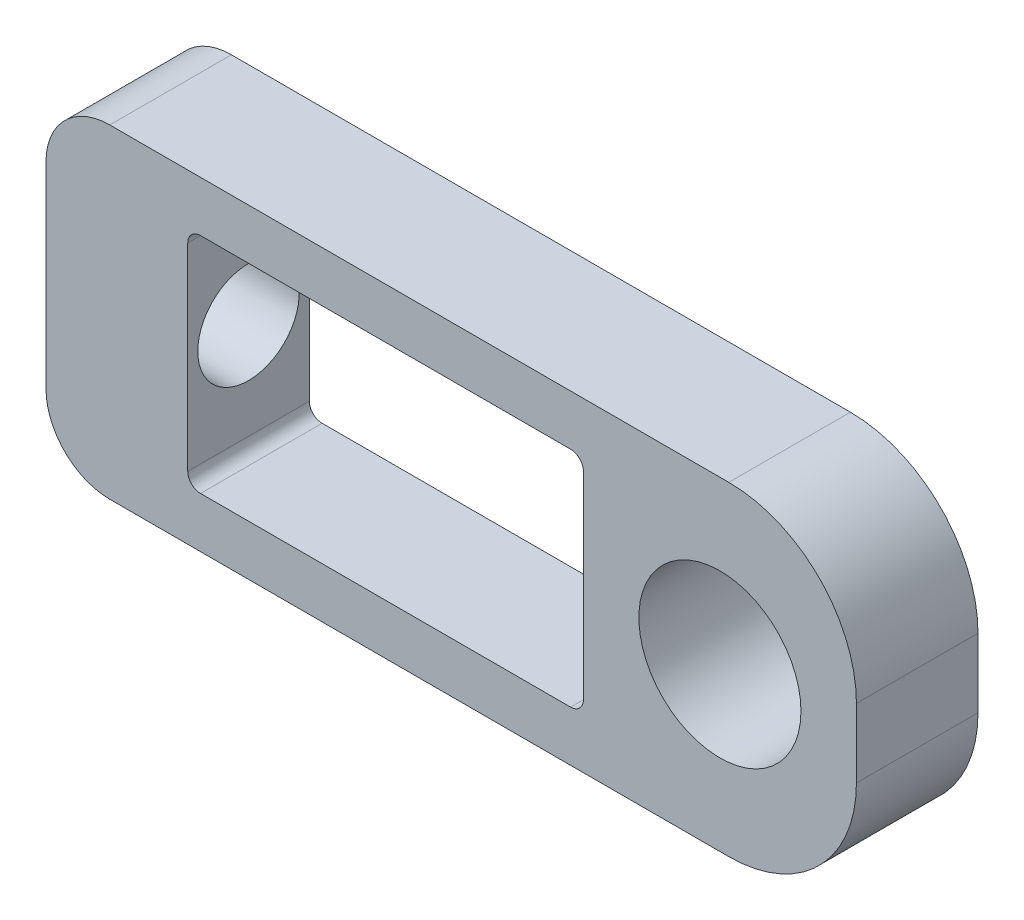
ISO-10303-21;
HEADER;
FILE_DESCRIPTION(('STEP AP214'),'2;1');
FILE_NAME('part.step','',(''),(''),'','','');
FILE_SCHEMA(('AUTOMOTIVE_DESIGN { 1 0 10303 214 1 1 1 1 }'));
ENDSEC;
DATA;
#1=APPLICATION_CONTEXT('core data for automotive mechanical design processes');
#2=APPLICATION_PROTOCOL_DEFINITION('international standard','automotive_design',2000,#1);
#3=PRODUCT_CONTEXT('',#1,'mechanical');
#4=PRODUCT('Part','Part','',(#3));
#5=PRODUCT_RELATED_PRODUCT_CATEGORY('part','',(#4));
#6=PRODUCT_DEFINITION_FORMATION('','',#4);
#7=PRODUCT_DEFINITION_CONTEXT('part definition',#1,'design');
#8=PRODUCT_DEFINITION('design','',#6,#7);
#9=PRODUCT_DEFINITION_SHAPE('','',#8);
#10=(LENGTH_UNIT() NAMED_UNIT(*) SI_UNIT(.MILLI.,.METRE.));
#11=(NAMED_UNIT(*) PLANE_ANGLE_UNIT() SI_UNIT($,.RADIAN.));
#12=(NAMED_UNIT(*) SI_UNIT($,.STERADIAN.) SOLID_ANGLE_UNIT());
#13=UNCERTAINTY_MEASURE_WITH_UNIT(LENGTH_MEASURE(1.E-05),#10,'distance_accuracy_value','');
#14=(GEOMETRIC_REPRESENTATION_CONTEXT(3) GLOBAL_UNCERTAINTY_ASSIGNED_CONTEXT((#13)) GLOBAL_UNIT_ASSIGNED_CONTEXT((#10,
#11,#12)) REPRESENTATION_CONTEXT('',''));
#15=CARTESIAN_POINT('',(0.,0.,0.));
#16=DIRECTION('',(0.,0.,1.));
#17=DIRECTION('',(1.,0.,0.));
#18=AXIS2_PLACEMENT_3D('',#15,#16,#17);
#19=CARTESIAN_POINT('',(0.,0.,9.525));
#20=DIRECTION('',(1.,0.,0.));
#21=DIRECTION('',(0.,0.,-1.));
#22=AXIS2_PLACEMENT_3D('',#19,#20,#21);
#23=PLANE('',#22);
#24=CARTESIAN_POINT('',(0.,12.7,4.7625));
#25=DIRECTION('',(-1.,0.,0.));
#26=DIRECTION('',(0.,0.,1.));
#27=AXIS2_PLACEMENT_3D('',#24,#25,#26);
#28=CIRCLE('',#27,3.9751);
#29=CARTESIAN_POINT('',(0.,12.7,8.7376));
#30=VERTEX_POINT('',#29);
#31=EDGE_CURVE('E312',#30,#30,#28,.T.);
#32=ORIENTED_EDGE('',*,*,#31,.F.);
#33=EDGE_LOOP('',(#32));
#34=FACE_BOUND('',#33,.T.);
#35=DIRECTION('',(0.,-1.,0.));
#36=VECTOR('',#35,1.);
#37=CARTESIAN_POINT('',(0.,0.,0.));
#38=LINE('',#37,#36);
#39=CARTESIAN_POINT('',(0.,20.4,0.));
#40=VERTEX_POINT('',#39);
#41=CARTESIAN_POINT('',(0.,5.,0.));
#42=VERTEX_POINT('',#41);
#43=EDGE_CURVE('E191',#40,#42,#38,.T.);
#44=ORIENTED_EDGE('',*,*,#43,.T.);
#45=DIRECTION('',(0.,0.,-1.));
#46=VECTOR('',#45,1.);
#47=CARTESIAN_POINT('',(0.,5.,9.525));
#48=LINE('',#47,#46);
#49=CARTESIAN_POINT('',(0.,5.,9.525));
#50=VERTEX_POINT('',#49);
#51=EDGE_CURVE('E216',#42,#50,#48,.F.);
#52=ORIENTED_EDGE('',*,*,#51,.T.);
#53=DIRECTION('',(0.,-1.,0.));
#54=VECTOR('',#53,1.);
#55=CARTESIAN_POINT('',(0.,0.,9.525));
#56=LINE('',#55,#54);
#57=CARTESIAN_POINT('',(0.,20.4,9.525));
#58=VERTEX_POINT('',#57);
#59=EDGE_CURVE('E189',#58,#50,#56,.T.);
#60=ORIENTED_EDGE('',*,*,#59,.F.);
#61=DIRECTION('',(0.,0.,-1.));
#62=VECTOR('',#61,1.);
#63=CARTESIAN_POINT('',(0.,20.4,9.525));
#64=LINE('',#63,#62);
#65=EDGE_CURVE('E213',#58,#40,#64,.T.);
#66=ORIENTED_EDGE('',*,*,#65,.T.);
#67=EDGE_LOOP('',(#44,#52,#60,#66));
#68=FACE_BOUND('',#67,.T.);
#69=ADVANCED_FACE('F46',(#34,#68),#23,.F.);
#70=CARTESIAN_POINT('',(0.,0.,9.525));
#71=DIRECTION('',(0.,1.,0.));
#72=DIRECTION('',(0.,0.,1.));
#73=AXIS2_PLACEMENT_3D('',#70,#71,#72);
#74=PLANE('',#73);
#75=DIRECTION('',(1.,0.,0.));
#76=VECTOR('',#75,1.);
#77=CARTESIAN_POINT('',(0.,0.,9.525));
#78=LINE('',#77,#76);
#79=CARTESIAN_POINT('',(5.,0.,9.525));
#80=VERTEX_POINT('',#79);
#81=CARTESIAN_POINT('',(53.5,0.,9.525));
#82=VERTEX_POINT('',#81);
#83=EDGE_CURVE('E295',#80,#82,#78,.T.);
#84=ORIENTED_EDGE('',*,*,#83,.F.);
#85=DIRECTION('',(0.,0.,-1.));
#86=VECTOR('',#85,1.);
#87=CARTESIAN_POINT('',(5.,0.,9.525));
#88=LINE('',#87,#86);
#89=CARTESIAN_POINT('',(5.,0.,0.));
#90=VERTEX_POINT('',#89);
#91=EDGE_CURVE('E206',#80,#90,#88,.T.);
#92=ORIENTED_EDGE('',*,*,#91,.T.);
#93=DIRECTION('',(1.,0.,0.));
#94=VECTOR('',#93,1.);
#95=CARTESIAN_POINT('',(0.,0.,0.));
#96=LINE('',#95,#94);
#97=CARTESIAN_POINT('',(53.5,0.,0.));
#98=VERTEX_POINT('',#97);
#99=EDGE_CURVE('E186',#90,#98,#96,.T.);
#100=ORIENTED_EDGE('',*,*,#99,.T.);
#101=DIRECTION('',(0.,0.,-1.));
#102=VECTOR('',#101,1.);
#103=CARTESIAN_POINT('',(53.5,0.,9.525));
#104=LINE('',#103,#102);
#105=EDGE_CURVE('E167',#98,#82,#104,.F.);
#106=ORIENTED_EDGE('',*,*,#105,.T.);
#107=EDGE_LOOP('',(#84,#92,#100,#106));
#108=FACE_BOUND('',#107,.T.);
#109=ADVANCED_FACE('F320',(#108),#74,.F.);
#110=CARTESIAN_POINT('',(63.5,0.,9.525));
#111=DIRECTION('',(-1.,0.,0.));
#112=DIRECTION('',(0.,0.,1.));
#113=AXIS2_PLACEMENT_3D('',#110,#111,#112);
#114=PLANE('',#113);
#115=DIRECTION('',(0.,1.,0.));
#116=VECTOR('',#115,1.);
#117=CARTESIAN_POINT('',(63.5,0.,9.525));
#118=LINE('',#117,#116);
#119=CARTESIAN_POINT('',(63.5,10.,9.525));
#120=VERTEX_POINT('',#119);
#121=CARTESIAN_POINT('',(63.5,15.4,9.525));
#122=VERTEX_POINT('',#121);
#123=EDGE_CURVE('E180',#120,#122,#118,.T.);
#124=ORIENTED_EDGE('',*,*,#123,.F.);
#125=DIRECTION('',(0.,0.,-1.));
#126=VECTOR('',#125,1.);
#127=CARTESIAN_POINT('',(63.5,10.,9.525));
#128=LINE('',#127,#126);
#129=CARTESIAN_POINT('',(63.5,10.,0.));
#130=VERTEX_POINT('',#129);
#131=EDGE_CURVE('E165',#120,#130,#128,.T.);
#132=ORIENTED_EDGE('',*,*,#131,.T.);
#133=DIRECTION('',(0.,1.,0.));
#134=VECTOR('',#133,1.);
#135=CARTESIAN_POINT('',(63.5,0.,0.));
#136=LINE('',#135,#134);
#137=CARTESIAN_POINT('',(63.5,15.4,0.));
#138=VERTEX_POINT('',#137);
#139=EDGE_CURVE('E177',#130,#138,#136,.T.);
#140=ORIENTED_EDGE('',*,*,#139,.T.);
#141=DIRECTION('',(0.,0.,-1.));
#142=VECTOR('',#141,1.);
#143=CARTESIAN_POINT('',(63.5,15.4,9.525));
#144=LINE('',#143,#142);
#145=EDGE_CURVE('E181',#138,#122,#144,.F.);
#146=ORIENTED_EDGE('',*,*,#145,.T.);
#147=EDGE_LOOP('',(#124,#132,#140,#146));
#148=FACE_BOUND('',#147,.T.);
#149=ADVANCED_FACE('F176',(#148),#114,.F.);
#150=CARTESIAN_POINT('',(0.,25.4,9.525));
#151=DIRECTION('',(0.,-1.,0.));
#152=DIRECTION('',(1.,0.,0.));
#153=AXIS2_PLACEMENT_3D('',#150,#151,#152);
#154=PLANE('',#153);
#155=DIRECTION('',(-1.,0.,0.));
#156=VECTOR('',#155,1.);
#157=CARTESIAN_POINT('',(0.,25.4,0.));
#158=LINE('',#157,#156);
#159=CARTESIAN_POINT('',(53.5,25.4,0.));
#160=VERTEX_POINT('',#159);
#161=CARTESIAN_POINT('',(5.,25.4,0.));
#162=VERTEX_POINT('',#161);
#163=EDGE_CURVE('E185',#160,#162,#158,.T.);
#164=ORIENTED_EDGE('',*,*,#163,.T.);
#165=DIRECTION('',(0.,0.,-1.));
#166=VECTOR('',#165,1.);
#167=CARTESIAN_POINT('',(5.,25.4,9.525));
#168=LINE('',#167,#166);
#169=CARTESIAN_POINT('',(5.,25.4,9.525));
#170=VERTEX_POINT('',#169);
#171=EDGE_CURVE('E222',#162,#170,#168,.F.);
#172=ORIENTED_EDGE('',*,*,#171,.T.);
#173=DIRECTION('',(-1.,0.,0.));
#174=VECTOR('',#173,1.);
#175=CARTESIAN_POINT('',(0.,25.4,9.525));
#176=LINE('',#175,#174);
#177=CARTESIAN_POINT('',(53.5,25.4,9.525));
#178=VERTEX_POINT('',#177);
#179=EDGE_CURVE('E195',#178,#170,#176,.T.);
#180=ORIENTED_EDGE('',*,*,#179,.F.);
#181=DIRECTION('',(0.,0.,-1.));
#182=VECTOR('',#181,1.);
#183=CARTESIAN_POINT('',(53.5,25.4,9.525));
#184=LINE('',#183,#182);
#185=EDGE_CURVE('E203',#178,#160,#184,.T.);
#186=ORIENTED_EDGE('',*,*,#185,.T.);
#187=EDGE_LOOP('',(#164,#172,#180,#186));
#188=FACE_BOUND('',#187,.T.);
#189=ADVANCED_FACE('F386',(#188),#154,.F.);
#190=CARTESIAN_POINT('',(0.,0.,9.525));
#191=DIRECTION('',(0.,0.,-1.));
#192=DIRECTION('',(-1.,0.,0.));
#193=AXIS2_PLACEMENT_3D('',#190,#191,#192);
#194=PLANE('',#193);
#195=CARTESIAN_POINT('',(52.803125,12.7,9.525));
#196=DIRECTION('',(0.,0.,1.));
#197=DIRECTION('',(1.,0.,0.));
#198=AXIS2_PLACEMENT_3D('',#195,#196,#197);
#199=CIRCLE('',#198,6.35);
#200=CARTESIAN_POINT('',(59.153125,12.7,9.525));
#201=VERTEX_POINT('',#200);
#202=EDGE_CURVE('E285',#201,#201,#199,.T.);
#203=ORIENTED_EDGE('',*,*,#202,.F.);
#204=EDGE_LOOP('',(#203));
#205=FACE_BOUND('',#204,.T.);
#206=DIRECTION('',(-1.,0.,0.));
#207=VECTOR('',#206,1.);
#208=CARTESIAN_POINT('',(11.10625,21.45,9.525));
#209=LINE('',#208,#207);
#210=CARTESIAN_POINT('',(41.10625,21.45,9.525));
#211=VERTEX_POINT('',#210);
#212=CARTESIAN_POINT('',(12.10625,21.45,9.525));
#213=VERTEX_POINT('',#212);
#214=EDGE_CURVE('E260',#211,#213,#209,.T.);
#215=ORIENTED_EDGE('',*,*,#214,.F.);
#216=CARTESIAN_POINT('',(41.10625,20.45,9.525));
#217=DIRECTION('',(0.,0.,-1.));
#218=DIRECTION('',(-1.,0.,0.));
#219=AXIS2_PLACEMENT_3D('',#216,#217,#218);
#220=CIRCLE('',#219,1.);
#221=CARTESIAN_POINT('',(42.10625,20.45,9.525));
#222=VERTEX_POINT('',#221);
#223=EDGE_CURVE('E54',#211,#222,#220,.T.);
#224=ORIENTED_EDGE('',*,*,#223,.T.);
#225=DIRECTION('',(0.,1.,0.));
#226=VECTOR('',#225,1.);
#227=CARTESIAN_POINT('',(42.10625,3.95,9.525));
#228=LINE('',#227,#226);
#229=CARTESIAN_POINT('',(42.10625,4.95,9.525));
#230=VERTEX_POINT('',#229);
#231=EDGE_CURVE('E258',#230,#222,#228,.T.);
#232=ORIENTED_EDGE('',*,*,#231,.F.);
#233=CARTESIAN_POINT('',(41.10625,4.95,9.525));
#234=DIRECTION('',(0.,0.,-1.));
#235=DIRECTION('',(-1.,0.,0.));
#236=AXIS2_PLACEMENT_3D('',#233,#234,#235);
#237=CIRCLE('',#236,1.);
#238=CARTESIAN_POINT('',(41.10625,3.95,9.525));
#239=VERTEX_POINT('',#238);
#240=EDGE_CURVE('E251',#230,#239,#237,.T.);
#241=ORIENTED_EDGE('',*,*,#240,.T.);
#242=DIRECTION('',(1.,0.,0.));
#243=VECTOR('',#242,1.);
#244=CARTESIAN_POINT('',(11.10625,3.95,9.525));
#245=LINE('',#244,#243);
#246=CARTESIAN_POINT('',(12.10625,3.95,9.525));
#247=VERTEX_POINT('',#246);
#248=EDGE_CURVE('E281',#247,#239,#245,.T.);
#249=ORIENTED_EDGE('',*,*,#248,.F.);
#250=CARTESIAN_POINT('',(12.10625,4.95,9.525));
#251=DIRECTION('',(0.,0.,-1.));
#252=DIRECTION('',(-1.,0.,0.));
#253=AXIS2_PLACEMENT_3D('',#250,#251,#252);
#254=CIRCLE('',#253,1.);
#255=CARTESIAN_POINT('',(11.10625,4.95,9.525));
#256=VERTEX_POINT('',#255);
#257=EDGE_CURVE('E247',#247,#256,#254,.T.);
#258=ORIENTED_EDGE('',*,*,#257,.T.);
#259=DIRECTION('',(0.,-1.,0.));
#260=VECTOR('',#259,1.);
#261=CARTESIAN_POINT('',(11.10625,3.95,9.525));
#262=LINE('',#261,#260);
#263=CARTESIAN_POINT('',(11.10625,20.45,9.525));
#264=VERTEX_POINT('',#263);
#265=EDGE_CURVE('E288',#264,#256,#262,.T.);
#266=ORIENTED_EDGE('',*,*,#265,.F.);
#267=CARTESIAN_POINT('',(12.10625,20.45,9.525));
#268=DIRECTION('',(0.,0.,-1.));
#269=DIRECTION('',(-1.,0.,0.));
#270=AXIS2_PLACEMENT_3D('',#267,#268,#269);
#271=CIRCLE('',#270,1.);
#272=EDGE_CURVE('E243',#264,#213,#271,.T.);
#273=ORIENTED_EDGE('',*,*,#272,.T.);
#274=EDGE_LOOP('',(#215,#224,#232,#241,#249,#258,#266,#273));
#275=FACE_BOUND('',#274,.T.);
#276=ORIENTED_EDGE('',*,*,#59,.T.);
#277=CARTESIAN_POINT('',(5.,5.,9.525));
#278=DIRECTION('',(0.,0.,-1.));
#279=DIRECTION('',(-1.,0.,0.));
#280=AXIS2_PLACEMENT_3D('',#277,#278,#279);
#281=CIRCLE('',#280,5.);
#282=EDGE_CURVE('E220',#50,#80,#281,.F.);
#283=ORIENTED_EDGE('',*,*,#282,.T.);
#284=ORIENTED_EDGE('',*,*,#83,.T.);
#285=CARTESIAN_POINT('',(53.5,10.,9.525));
#286=DIRECTION('',(0.,0.,-1.));
#287=DIRECTION('',(-1.,0.,0.));
#288=AXIS2_PLACEMENT_3D('',#285,#286,#287);
#289=CIRCLE('',#288,10.);
#290=EDGE_CURVE('E201',#82,#120,#289,.F.);
#291=ORIENTED_EDGE('',*,*,#290,.T.);
#292=ORIENTED_EDGE('',*,*,#123,.T.);
#293=CARTESIAN_POINT('',(53.5,15.4,9.525));
#294=DIRECTION('',(0.,0.,-1.));
#295=DIRECTION('',(-1.,0.,0.));
#296=AXIS2_PLACEMENT_3D('',#293,#294,#295);
#297=CIRCLE('',#296,10.);
#298=EDGE_CURVE('E199',#122,#178,#297,.F.);
#299=ORIENTED_EDGE('',*,*,#298,.T.);
#300=ORIENTED_EDGE('',*,*,#179,.T.);
#301=CARTESIAN_POINT('',(5.,20.4,9.525));
#302=DIRECTION('',(0.,0.,-1.));
#303=DIRECTION('',(-1.,0.,0.));
#304=AXIS2_PLACEMENT_3D('',#301,#302,#303);
#305=CIRCLE('',#304,5.);
#306=EDGE_CURVE('E218',#170,#58,#305,.F.);
#307=ORIENTED_EDGE('',*,*,#306,.T.);
#308=EDGE_LOOP('',(#276,#283,#284,#291,#292,#299,#300,#307));
#309=FACE_BOUND('',#308,.T.);
#310=ADVANCED_FACE('F256',(#205,#275,#309),#194,.F.);
#311=CARTESIAN_POINT('',(0.,0.,0.));
#312=DIRECTION('',(0.,0.,-1.));
#313=DIRECTION('',(-1.,0.,0.));
#314=AXIS2_PLACEMENT_3D('',#311,#312,#313);
#315=PLANE('',#314);
#316=CARTESIAN_POINT('',(52.803125,12.7,0.));
#317=DIRECTION('',(0.,0.,1.));
#318=DIRECTION('',(1.,0.,0.));
#319=AXIS2_PLACEMENT_3D('',#316,#317,#318);
#320=CIRCLE('',#319,6.35);
#321=CARTESIAN_POINT('',(59.153125,12.7,0.));
#322=VERTEX_POINT('',#321);
#323=EDGE_CURVE('E300',#322,#322,#320,.T.);
#324=ORIENTED_EDGE('',*,*,#323,.T.);
#325=EDGE_LOOP('',(#324));
#326=FACE_BOUND('',#325,.T.);
#327=DIRECTION('',(1.,0.,0.));
#328=VECTOR('',#327,1.);
#329=CARTESIAN_POINT('',(11.10625,3.95,0.));
#330=LINE('',#329,#328);
#331=CARTESIAN_POINT('',(12.10625,3.95,0.));
#332=VERTEX_POINT('',#331);
#333=CARTESIAN_POINT('',(41.10625,3.95,0.));
#334=VERTEX_POINT('',#333);
#335=EDGE_CURVE('E279',#332,#334,#330,.T.);
#336=ORIENTED_EDGE('',*,*,#335,.T.);
#337=CARTESIAN_POINT('',(41.10625,4.95,0.));
#338=DIRECTION('',(0.,0.,-1.));
#339=DIRECTION('',(-1.,0.,0.));
#340=AXIS2_PLACEMENT_3D('',#337,#338,#339);
#341=CIRCLE('',#340,1.);
#342=CARTESIAN_POINT('',(42.10625,4.95,0.));
#343=VERTEX_POINT('',#342);
#344=EDGE_CURVE('E68',#334,#343,#341,.F.);
#345=ORIENTED_EDGE('',*,*,#344,.T.);
#346=DIRECTION('',(0.,1.,0.));
#347=VECTOR('',#346,1.);
#348=CARTESIAN_POINT('',(42.10625,3.95,0.));
#349=LINE('',#348,#347);
#350=CARTESIAN_POINT('',(42.10625,20.45,0.));
#351=VERTEX_POINT('',#350);
#352=EDGE_CURVE('E272',#343,#351,#349,.T.);
#353=ORIENTED_EDGE('',*,*,#352,.T.);
#354=CARTESIAN_POINT('',(41.10625,20.45,0.));
#355=DIRECTION('',(0.,0.,-1.));
#356=DIRECTION('',(-1.,0.,0.));
#357=AXIS2_PLACEMENT_3D('',#354,#355,#356);
#358=CIRCLE('',#357,1.);
#359=CARTESIAN_POINT('',(41.10625,21.45,0.));
#360=VERTEX_POINT('',#359);
#361=EDGE_CURVE('E13',#351,#360,#358,.F.);
#362=ORIENTED_EDGE('',*,*,#361,.T.);
#363=DIRECTION('',(-1.,0.,0.));
#364=VECTOR('',#363,1.);
#365=CARTESIAN_POINT('',(11.10625,21.45,0.));
#366=LINE('',#365,#364);
#367=CARTESIAN_POINT('',(12.10625,21.45,0.));
#368=VERTEX_POINT('',#367);
#369=EDGE_CURVE('E270',#360,#368,#366,.T.);
#370=ORIENTED_EDGE('',*,*,#369,.T.);
#371=CARTESIAN_POINT('',(12.10625,20.45,0.));
#372=DIRECTION('',(0.,0.,-1.));
#373=DIRECTION('',(-1.,0.,0.));
#374=AXIS2_PLACEMENT_3D('',#371,#372,#373);
#375=CIRCLE('',#374,1.);
#376=CARTESIAN_POINT('',(11.10625,20.45,0.));
#377=VERTEX_POINT('',#376);
#378=EDGE_CURVE('E245',#368,#377,#375,.F.);
#379=ORIENTED_EDGE('',*,*,#378,.T.);
#380=DIRECTION('',(0.,-1.,0.));
#381=VECTOR('',#380,1.);
#382=CARTESIAN_POINT('',(11.10625,3.95,0.));
#383=LINE('',#382,#381);
#384=CARTESIAN_POINT('',(11.10625,4.95,0.));
#385=VERTEX_POINT('',#384);
#386=EDGE_CURVE('E276',#377,#385,#383,.T.);
#387=ORIENTED_EDGE('',*,*,#386,.T.);
#388=CARTESIAN_POINT('',(12.10625,4.95,0.));
#389=DIRECTION('',(0.,0.,-1.));
#390=DIRECTION('',(-1.,0.,0.));
#391=AXIS2_PLACEMENT_3D('',#388,#389,#390);
#392=CIRCLE('',#391,1.);
#393=EDGE_CURVE('E249',#385,#332,#392,.F.);
#394=ORIENTED_EDGE('',*,*,#393,.T.);
#395=EDGE_LOOP('',(#336,#345,#353,#362,#370,#379,#387,#394));
#396=FACE_BOUND('',#395,.T.);
#397=ORIENTED_EDGE('',*,*,#99,.F.);
#398=CARTESIAN_POINT('',(5.,5.,0.));
#399=DIRECTION('',(0.,0.,-1.));
#400=DIRECTION('',(-1.,0.,0.));
#401=AXIS2_PLACEMENT_3D('',#398,#399,#400);
#402=CIRCLE('',#401,5.);
#403=EDGE_CURVE('E211',#90,#42,#402,.T.);
#404=ORIENTED_EDGE('',*,*,#403,.T.);
#405=ORIENTED_EDGE('',*,*,#43,.F.);
#406=CARTESIAN_POINT('',(5.,20.4,0.));
#407=DIRECTION('',(0.,0.,-1.));
#408=DIRECTION('',(-1.,0.,0.));
#409=AXIS2_PLACEMENT_3D('',#406,#407,#408);
#410=CIRCLE('',#409,5.);
#411=EDGE_CURVE('E209',#40,#162,#410,.T.);
#412=ORIENTED_EDGE('',*,*,#411,.T.);
#413=ORIENTED_EDGE('',*,*,#163,.F.);
#414=CARTESIAN_POINT('',(53.5,15.4,0.));
#415=DIRECTION('',(0.,0.,-1.));
#416=DIRECTION('',(-1.,0.,0.));
#417=AXIS2_PLACEMENT_3D('',#414,#415,#416);
#418=CIRCLE('',#417,10.);
#419=EDGE_CURVE('E171',#160,#138,#418,.T.);
#420=ORIENTED_EDGE('',*,*,#419,.T.);
#421=ORIENTED_EDGE('',*,*,#139,.F.);
#422=CARTESIAN_POINT('',(53.5,10.,0.));
#423=DIRECTION('',(0.,0.,-1.));
#424=DIRECTION('',(-1.,0.,0.));
#425=AXIS2_PLACEMENT_3D('',#422,#423,#424);
#426=CIRCLE('',#425,10.);
#427=EDGE_CURVE('E161',#130,#98,#426,.T.);
#428=ORIENTED_EDGE('',*,*,#427,.T.);
#429=EDGE_LOOP('',(#397,#404,#405,#412,#413,#420,#421,#428));
#430=FACE_BOUND('',#429,.T.);
#431=ADVANCED_FACE('F183',(#326,#396,#430),#315,.T.);
#432=CARTESIAN_POINT('',(42.10625,3.95,0.));
#433=DIRECTION('',(1.,0.,0.));
#434=DIRECTION('',(0.,0.,-1.));
#435=AXIS2_PLACEMENT_3D('',#432,#433,#434);
#436=PLANE('',#435);
#437=ORIENTED_EDGE('',*,*,#352,.F.);
#438=DIRECTION('',(0.,0.,1.));
#439=VECTOR('',#438,1.);
#440=CARTESIAN_POINT('',(42.10625,4.95,9.525));
#441=LINE('',#440,#439);
#442=EDGE_CURVE('E240',#343,#230,#441,.T.);
#443=ORIENTED_EDGE('',*,*,#442,.T.);
#444=ORIENTED_EDGE('',*,*,#231,.T.);
#445=DIRECTION('',(0.,0.,1.));
#446=VECTOR('',#445,1.);
#447=CARTESIAN_POINT('',(42.10625,20.45,0.));
#448=LINE('',#447,#446);
#449=EDGE_CURVE('E61',#222,#351,#448,.F.);
#450=ORIENTED_EDGE('',*,*,#449,.T.);
#451=EDGE_LOOP('',(#437,#443,#444,#450));
#452=FACE_BOUND('',#451,.T.);
#453=ADVANCED_FACE('F263',(#452),#436,.F.);
#454=CARTESIAN_POINT('',(11.10625,3.95,0.));
#455=DIRECTION('',(0.,-1.,0.));
#456=DIRECTION('',(0.,0.,-1.));
#457=AXIS2_PLACEMENT_3D('',#454,#455,#456);
#458=PLANE('',#457);
#459=ORIENTED_EDGE('',*,*,#335,.F.);
#460=DIRECTION('',(0.,0.,1.));
#461=VECTOR('',#460,1.);
#462=CARTESIAN_POINT('',(12.10625,3.95,9.525));
#463=LINE('',#462,#461);
#464=EDGE_CURVE('E236',#332,#247,#463,.T.);
#465=ORIENTED_EDGE('',*,*,#464,.T.);
#466=ORIENTED_EDGE('',*,*,#248,.T.);
#467=DIRECTION('',(0.,0.,1.));
#468=VECTOR('',#467,1.);
#469=CARTESIAN_POINT('',(41.10625,3.95,0.));
#470=LINE('',#469,#468);
#471=EDGE_CURVE('E234',#239,#334,#470,.F.);
#472=ORIENTED_EDGE('',*,*,#471,.T.);
#473=EDGE_LOOP('',(#459,#465,#466,#472));
#474=FACE_BOUND('',#473,.T.);
#475=ADVANCED_FACE('F360',(#474),#458,.F.);
#476=CARTESIAN_POINT('',(11.10625,3.95,0.));
#477=DIRECTION('',(-1.,0.,0.));
#478=DIRECTION('',(0.,0.,1.));
#479=AXIS2_PLACEMENT_3D('',#476,#477,#478);
#480=PLANE('',#479);
#481=CARTESIAN_POINT('',(11.10625,12.7,4.7625));
#482=DIRECTION('',(-1.,0.,0.));
#483=DIRECTION('',(0.,0.,1.));
#484=AXIS2_PLACEMENT_3D('',#481,#482,#483);
#485=CIRCLE('',#484,3.9751);
#486=CARTESIAN_POINT('',(11.10625,12.7,8.7376));
#487=VERTEX_POINT('',#486);
#488=EDGE_CURVE('E265',#487,#487,#485,.F.);
#489=ORIENTED_EDGE('',*,*,#488,.F.);
#490=EDGE_LOOP('',(#489));
#491=FACE_BOUND('',#490,.T.);
#492=ORIENTED_EDGE('',*,*,#386,.F.);
#493=DIRECTION('',(0.,0.,1.));
#494=VECTOR('',#493,1.);
#495=CARTESIAN_POINT('',(11.10625,20.45,9.525));
#496=LINE('',#495,#494);
#497=EDGE_CURVE('E226',#377,#264,#496,.T.);
#498=ORIENTED_EDGE('',*,*,#497,.T.);
#499=ORIENTED_EDGE('',*,*,#265,.T.);
#500=DIRECTION('',(0.,0.,1.));
#501=VECTOR('',#500,1.);
#502=CARTESIAN_POINT('',(11.10625,4.95,0.));
#503=LINE('',#502,#501);
#504=EDGE_CURVE('E224',#256,#385,#503,.F.);
#505=ORIENTED_EDGE('',*,*,#504,.T.);
#506=EDGE_LOOP('',(#492,#498,#499,#505));
#507=FACE_BOUND('',#506,.T.);
#508=ADVANCED_FACE('F367',(#491,#507),#480,.F.);
#509=CARTESIAN_POINT('',(11.10625,21.45,0.));
#510=DIRECTION('',(0.,1.,0.));
#511=DIRECTION('',(0.,0.,1.));
#512=AXIS2_PLACEMENT_3D('',#509,#510,#511);
#513=PLANE('',#512);
#514=ORIENTED_EDGE('',*,*,#214,.T.);
#515=DIRECTION('',(0.,0.,1.));
#516=VECTOR('',#515,1.);
#517=CARTESIAN_POINT('',(12.10625,21.45,0.));
#518=LINE('',#517,#516);
#519=EDGE_CURVE('E232',#213,#368,#518,.F.);
#520=ORIENTED_EDGE('',*,*,#519,.T.);
#521=ORIENTED_EDGE('',*,*,#369,.F.);
#522=DIRECTION('',(0.,0.,1.));
#523=VECTOR('',#522,1.);
#524=CARTESIAN_POINT('',(41.10625,21.45,9.525));
#525=LINE('',#524,#523);
#526=EDGE_CURVE('E229',#360,#211,#525,.T.);
#527=ORIENTED_EDGE('',*,*,#526,.T.);
#528=EDGE_LOOP('',(#514,#520,#521,#527));
#529=FACE_BOUND('',#528,.T.);
#530=ADVANCED_FACE('F274',(#529),#513,.F.);
#531=CARTESIAN_POINT('',(52.803125,12.7,0.));
#532=DIRECTION('',(0.,0.,1.));
#533=DIRECTION('',(1.,0.,0.));
#534=AXIS2_PLACEMENT_3D('',#531,#532,#533);
#535=CYLINDRICAL_SURFACE('',#534,6.35);
#536=ORIENTED_EDGE('',*,*,#323,.F.);
#537=EDGE_LOOP('',(#536));
#538=FACE_BOUND('',#537,.T.);
#539=ORIENTED_EDGE('',*,*,#202,.T.);
#540=EDGE_LOOP('',(#539));
#541=FACE_BOUND('',#540,.T.);
#542=ADVANCED_FACE('F376',(#538,#541),#535,.F.);
#543=CARTESIAN_POINT('',(63.501,12.7,4.7625));
#544=DIRECTION('',(-1.,0.,0.));
#545=DIRECTION('',(0.,0.,1.));
#546=AXIS2_PLACEMENT_3D('',#543,#544,#545);
#547=CYLINDRICAL_SURFACE('',#546,3.9751);
#548=ORIENTED_EDGE('',*,*,#31,.T.);
#549=EDGE_LOOP('',(#548));
#550=FACE_BOUND('',#549,.T.);
#551=ORIENTED_EDGE('',*,*,#488,.T.);
#552=EDGE_LOOP('',(#551));
#553=FACE_BOUND('',#552,.T.);
#554=ADVANCED_FACE('F316',(#550,#553),#547,.F.);
#555=CARTESIAN_POINT('',(53.5,10.,9.525));
#556=DIRECTION('',(0.,0.,-1.));
#557=DIRECTION('',(-1.,0.,0.));
#558=AXIS2_PLACEMENT_3D('',#555,#556,#557);
#559=CYLINDRICAL_SURFACE('',#558,10.);
#560=ORIENTED_EDGE('',*,*,#290,.F.);
#561=ORIENTED_EDGE('',*,*,#105,.F.);
#562=ORIENTED_EDGE('',*,*,#427,.F.);
#563=ORIENTED_EDGE('',*,*,#131,.F.);
#564=EDGE_LOOP('',(#560,#561,#562,#563));
#565=FACE_BOUND('',#564,.T.);
#566=ADVANCED_FACE('F164',(#565),#559,.T.);
#567=CARTESIAN_POINT('',(53.5,15.4,9.525));
#568=DIRECTION('',(0.,0.,-1.));
#569=DIRECTION('',(-1.,0.,0.));
#570=AXIS2_PLACEMENT_3D('',#567,#568,#569);
#571=CYLINDRICAL_SURFACE('',#570,10.);
#572=ORIENTED_EDGE('',*,*,#298,.F.);
#573=ORIENTED_EDGE('',*,*,#145,.F.);
#574=ORIENTED_EDGE('',*,*,#419,.F.);
#575=ORIENTED_EDGE('',*,*,#185,.F.);
#576=EDGE_LOOP('',(#572,#573,#574,#575));
#577=FACE_BOUND('',#576,.T.);
#578=ADVANCED_FACE('F331',(#577),#571,.T.);
#579=CARTESIAN_POINT('',(5.,5.,9.525));
#580=DIRECTION('',(0.,0.,-1.));
#581=DIRECTION('',(-1.,0.,0.));
#582=AXIS2_PLACEMENT_3D('',#579,#580,#581);
#583=CYLINDRICAL_SURFACE('',#582,5.);
#584=ORIENTED_EDGE('',*,*,#282,.F.);
#585=ORIENTED_EDGE('',*,*,#51,.F.);
#586=ORIENTED_EDGE('',*,*,#403,.F.);
#587=ORIENTED_EDGE('',*,*,#91,.F.);
#588=EDGE_LOOP('',(#584,#585,#586,#587));
#589=FACE_BOUND('',#588,.T.);
#590=ADVANCED_FACE('F334',(#589),#583,.T.);
#591=CARTESIAN_POINT('',(5.,20.4,9.525));
#592=DIRECTION('',(0.,0.,-1.));
#593=DIRECTION('',(-1.,0.,0.));
#594=AXIS2_PLACEMENT_3D('',#591,#592,#593);
#595=CYLINDRICAL_SURFACE('',#594,5.);
#596=ORIENTED_EDGE('',*,*,#306,.F.);
#597=ORIENTED_EDGE('',*,*,#171,.F.);
#598=ORIENTED_EDGE('',*,*,#411,.F.);
#599=ORIENTED_EDGE('',*,*,#65,.F.);
#600=EDGE_LOOP('',(#596,#597,#598,#599));
#601=FACE_BOUND('',#600,.T.);
#602=ADVANCED_FACE('F338',(#601),#595,.T.);
#603=CARTESIAN_POINT('',(12.10625,20.45,0.));
#604=DIRECTION('',(0.,0.,-1.));
#605=DIRECTION('',(-1.,0.,0.));
#606=AXIS2_PLACEMENT_3D('',#603,#604,#605);
#607=CYLINDRICAL_SURFACE('',#606,1.);
#608=ORIENTED_EDGE('',*,*,#378,.F.);
#609=ORIENTED_EDGE('',*,*,#519,.F.);
#610=ORIENTED_EDGE('',*,*,#272,.F.);
#611=ORIENTED_EDGE('',*,*,#497,.F.);
#612=EDGE_LOOP('',(#608,#609,#610,#611));
#613=FACE_BOUND('',#612,.T.);
#614=ADVANCED_FACE('F342',(#613),#607,.F.);
#615=CARTESIAN_POINT('',(12.10625,4.95,0.));
#616=DIRECTION('',(0.,0.,-1.));
#617=DIRECTION('',(-1.,0.,0.));
#618=AXIS2_PLACEMENT_3D('',#615,#616,#617);
#619=CYLINDRICAL_SURFACE('',#618,1.);
#620=ORIENTED_EDGE('',*,*,#393,.F.);
#621=ORIENTED_EDGE('',*,*,#504,.F.);
#622=ORIENTED_EDGE('',*,*,#257,.F.);
#623=ORIENTED_EDGE('',*,*,#464,.F.);
#624=EDGE_LOOP('',(#620,#621,#622,#623));
#625=FACE_BOUND('',#624,.T.);
#626=ADVANCED_FACE('F346',(#625),#619,.F.);
#627=CARTESIAN_POINT('',(41.10625,4.95,0.));
#628=DIRECTION('',(0.,0.,-1.));
#629=DIRECTION('',(-1.,0.,0.));
#630=AXIS2_PLACEMENT_3D('',#627,#628,#629);
#631=CYLINDRICAL_SURFACE('',#630,1.);
#632=ORIENTED_EDGE('',*,*,#344,.F.);
#633=ORIENTED_EDGE('',*,*,#471,.F.);
#634=ORIENTED_EDGE('',*,*,#240,.F.);
#635=ORIENTED_EDGE('',*,*,#442,.F.);
#636=EDGE_LOOP('',(#632,#633,#634,#635));
#637=FACE_BOUND('',#636,.T.);
#638=ADVANCED_FACE('F349',(#637),#631,.F.);
#639=CARTESIAN_POINT('',(41.10625,20.45,0.));
#640=DIRECTION('',(0.,0.,-1.));
#641=DIRECTION('',(-1.,0.,0.));
#642=AXIS2_PLACEMENT_3D('',#639,#640,#641);
#643=CYLINDRICAL_SURFACE('',#642,1.);
#644=ORIENTED_EDGE('',*,*,#361,.F.);
#645=ORIENTED_EDGE('',*,*,#449,.F.);
#646=ORIENTED_EDGE('',*,*,#223,.F.);
#647=ORIENTED_EDGE('',*,*,#526,.F.);
#648=EDGE_LOOP('',(#644,#645,#646,#647));
#649=FACE_BOUND('',#648,.T.);
#650=ADVANCED_FACE('F48',(#649),#643,.F.);
#651=CLOSED_SHELL('',(#69,#109,#149,#189,#310,#431,#453,#475,#508,#530,#542,#554,#566,#578,#590,
#602,#614,#626,#638,#650));
#652=MANIFOLD_SOLID_BREP('B2',#651);
#653=ADVANCED_BREP_SHAPE_REPRESENTATION('',(#18,#652),#14);
#654=SHAPE_DEFINITION_REPRESENTATION(#9,#653);
ENDSEC;
END-ISO-10303-21;
